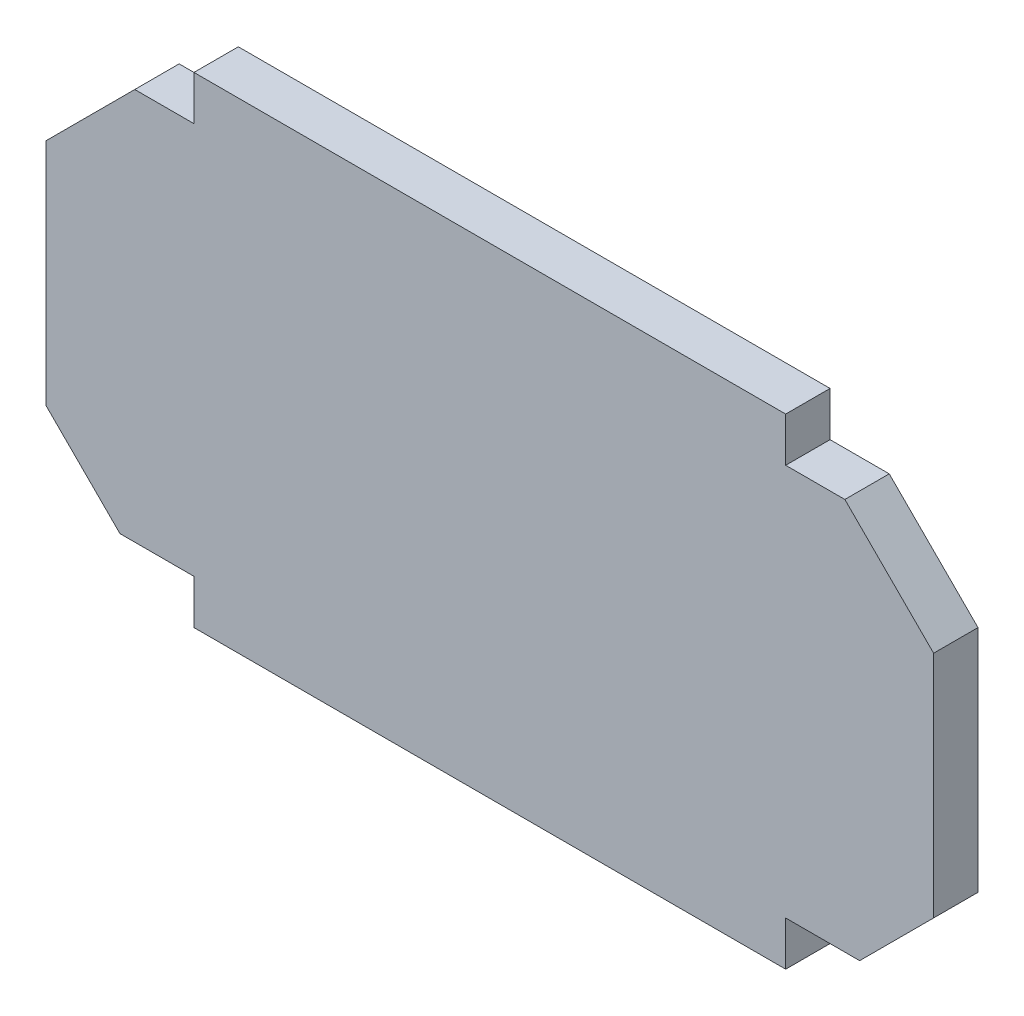
ISO-10303-21;
HEADER;
FILE_DESCRIPTION(('STEP AP214'),'2;1');
FILE_NAME('part.step','',(''),(''),'','','');
FILE_SCHEMA(('AUTOMOTIVE_DESIGN { 1 0 10303 214 1 1 1 1 }'));
ENDSEC;
DATA;
#1=APPLICATION_CONTEXT('core data for automotive mechanical design processes');
#2=APPLICATION_PROTOCOL_DEFINITION('international standard','automotive_design',2000,#1);
#3=PRODUCT_CONTEXT('',#1,'mechanical');
#4=PRODUCT('Part','Part','',(#3));
#5=PRODUCT_RELATED_PRODUCT_CATEGORY('part','',(#4));
#6=PRODUCT_DEFINITION_FORMATION('','',#4);
#7=PRODUCT_DEFINITION_CONTEXT('part definition',#1,'design');
#8=PRODUCT_DEFINITION('design','',#6,#7);
#9=PRODUCT_DEFINITION_SHAPE('','',#8);
#10=(LENGTH_UNIT() NAMED_UNIT(*) SI_UNIT(.MILLI.,.METRE.));
#11=(NAMED_UNIT(*) PLANE_ANGLE_UNIT() SI_UNIT($,.RADIAN.));
#12=(NAMED_UNIT(*) SI_UNIT($,.STERADIAN.) SOLID_ANGLE_UNIT());
#13=UNCERTAINTY_MEASURE_WITH_UNIT(LENGTH_MEASURE(1.E-05),#10,'distance_accuracy_value','');
#14=(GEOMETRIC_REPRESENTATION_CONTEXT(3) GLOBAL_UNCERTAINTY_ASSIGNED_CONTEXT((#13)) GLOBAL_UNIT_ASSIGNED_CONTEXT((#10,
#11,#12)) REPRESENTATION_CONTEXT('',''));
#15=CARTESIAN_POINT('',(0.,0.,0.));
#16=DIRECTION('',(0.,0.,1.));
#17=DIRECTION('',(1.,0.,0.));
#18=AXIS2_PLACEMENT_3D('',#15,#16,#17);
#19=CARTESIAN_POINT('',(-24.,31.5,3.));
#20=DIRECTION('',(0.707106781186547,-0.707106781186548,0.));
#21=DIRECTION('',(0.707106781186548,0.707106781186547,0.));
#22=AXIS2_PLACEMENT_3D('',#19,#20,#21);
#23=PLANE('',#22);
#24=DIRECTION('',(-0.707106781186548,-0.707106781186547,0.));
#25=VECTOR('',#24,1.);
#26=CARTESIAN_POINT('',(-24.,31.5,0.));
#27=LINE('',#26,#25);
#28=CARTESIAN_POINT('',(-24.,31.5,0.));
#29=VERTEX_POINT('',#28);
#30=CARTESIAN_POINT('',(-30.,25.5,0.));
#31=VERTEX_POINT('',#30);
#32=EDGE_CURVE('E188',#29,#31,#27,.T.);
#33=ORIENTED_EDGE('',*,*,#32,.T.);
#34=DIRECTION('',(0.,0.,-1.));
#35=VECTOR('',#34,1.);
#36=CARTESIAN_POINT('',(-30.,25.5,3.));
#37=LINE('',#36,#35);
#38=CARTESIAN_POINT('',(-30.,25.5,3.));
#39=VERTEX_POINT('',#38);
#40=EDGE_CURVE('E11',#39,#31,#37,.T.);
#41=ORIENTED_EDGE('',*,*,#40,.F.);
#42=DIRECTION('',(-0.707106781186548,-0.707106781186547,0.));
#43=VECTOR('',#42,1.);
#44=CARTESIAN_POINT('',(-24.,31.5,3.));
#45=LINE('',#44,#43);
#46=CARTESIAN_POINT('',(-24.,31.5,3.));
#47=VERTEX_POINT('',#46);
#48=EDGE_CURVE('E234',#47,#39,#45,.T.);
#49=ORIENTED_EDGE('',*,*,#48,.F.);
#50=DIRECTION('',(0.,0.,-1.));
#51=VECTOR('',#50,1.);
#52=CARTESIAN_POINT('',(-24.,31.5,3.));
#53=LINE('',#52,#51);
#54=EDGE_CURVE('E184',#47,#29,#53,.T.);
#55=ORIENTED_EDGE('',*,*,#54,.T.);
#56=EDGE_LOOP('',(#33,#41,#49,#55));
#57=FACE_BOUND('',#56,.T.);
#58=ADVANCED_FACE('F39',(#57),#23,.F.);
#59=CARTESIAN_POINT('',(-30.,25.5,3.));
#60=DIRECTION('',(1.,0.,0.));
#61=DIRECTION('',(0.,1.,0.));
#62=AXIS2_PLACEMENT_3D('',#59,#60,#61);
#63=PLANE('',#62);
#64=DIRECTION('',(0.,-1.,0.));
#65=VECTOR('',#64,1.);
#66=CARTESIAN_POINT('',(-30.,25.5,0.));
#67=LINE('',#66,#65);
#68=CARTESIAN_POINT('',(-30.,10.,0.));
#69=VERTEX_POINT('',#68);
#70=EDGE_CURVE('E192',#31,#69,#67,.T.);
#71=ORIENTED_EDGE('',*,*,#70,.T.);
#72=DIRECTION('',(0.,0.,-1.));
#73=VECTOR('',#72,1.);
#74=CARTESIAN_POINT('',(-30.,10.,3.));
#75=LINE('',#74,#73);
#76=CARTESIAN_POINT('',(-30.,10.,3.));
#77=VERTEX_POINT('',#76);
#78=EDGE_CURVE('E48',#77,#69,#75,.T.);
#79=ORIENTED_EDGE('',*,*,#78,.F.);
#80=DIRECTION('',(0.,-1.,0.));
#81=VECTOR('',#80,1.);
#82=CARTESIAN_POINT('',(-30.,25.5,3.));
#83=LINE('',#82,#81);
#84=EDGE_CURVE('E123',#39,#77,#83,.T.);
#85=ORIENTED_EDGE('',*,*,#84,.F.);
#86=ORIENTED_EDGE('',*,*,#40,.T.);
#87=EDGE_LOOP('',(#71,#79,#85,#86));
#88=FACE_BOUND('',#87,.T.);
#89=ADVANCED_FACE('F356',(#88),#63,.F.);
#90=CARTESIAN_POINT('',(-30.,10.,3.));
#91=DIRECTION('',(0.707106781186547,0.707106781186547,0.));
#92=DIRECTION('',(-0.707106781186548,0.707106781186548,0.));
#93=AXIS2_PLACEMENT_3D('',#90,#91,#92);
#94=PLANE('',#93);
#95=DIRECTION('',(0.707106781186548,-0.707106781186548,0.));
#96=VECTOR('',#95,1.);
#97=CARTESIAN_POINT('',(-30.,10.,0.));
#98=LINE('',#97,#96);
#99=CARTESIAN_POINT('',(-25.,5.00000000000004,0.));
#100=VERTEX_POINT('',#99);
#101=EDGE_CURVE('E195',#69,#100,#98,.T.);
#102=ORIENTED_EDGE('',*,*,#101,.T.);
#103=DIRECTION('',(0.,0.,-1.));
#104=VECTOR('',#103,1.);
#105=CARTESIAN_POINT('',(-25.,5.00000000000004,3.));
#106=LINE('',#105,#104);
#107=CARTESIAN_POINT('',(-25.,5.00000000000004,3.));
#108=VERTEX_POINT('',#107);
#109=EDGE_CURVE('E277',#108,#100,#106,.T.);
#110=ORIENTED_EDGE('',*,*,#109,.F.);
#111=DIRECTION('',(0.707106781186548,-0.707106781186548,0.));
#112=VECTOR('',#111,1.);
#113=CARTESIAN_POINT('',(-30.,10.,3.));
#114=LINE('',#113,#112);
#115=EDGE_CURVE('E287',#77,#108,#114,.T.);
#116=ORIENTED_EDGE('',*,*,#115,.F.);
#117=ORIENTED_EDGE('',*,*,#78,.T.);
#118=EDGE_LOOP('',(#102,#110,#116,#117));
#119=FACE_BOUND('',#118,.T.);
#120=ADVANCED_FACE('F285',(#119),#94,.F.);
#121=CARTESIAN_POINT('',(-25.,5.00000000000004,3.));
#122=DIRECTION('',(0.,1.,0.));
#123=DIRECTION('',(0.,0.,1.));
#124=AXIS2_PLACEMENT_3D('',#121,#122,#123);
#125=PLANE('',#124);
#126=DIRECTION('',(1.,0.,0.));
#127=VECTOR('',#126,1.);
#128=CARTESIAN_POINT('',(-25.,5.00000000000004,0.));
#129=LINE('',#128,#127);
#130=CARTESIAN_POINT('',(-20.,5.00000000000004,0.));
#131=VERTEX_POINT('',#130);
#132=EDGE_CURVE('E198',#100,#131,#129,.T.);
#133=ORIENTED_EDGE('',*,*,#132,.T.);
#134=DIRECTION('',(0.,0.,-1.));
#135=VECTOR('',#134,1.);
#136=CARTESIAN_POINT('',(-20.,5.00000000000004,3.));
#137=LINE('',#136,#135);
#138=CARTESIAN_POINT('',(-20.,5.00000000000004,3.));
#139=VERTEX_POINT('',#138);
#140=EDGE_CURVE('E273',#139,#131,#137,.T.);
#141=ORIENTED_EDGE('',*,*,#140,.F.);
#142=DIRECTION('',(1.,0.,0.));
#143=VECTOR('',#142,1.);
#144=CARTESIAN_POINT('',(-25.,5.00000000000004,3.));
#145=LINE('',#144,#143);
#146=EDGE_CURVE('E306',#108,#139,#145,.T.);
#147=ORIENTED_EDGE('',*,*,#146,.F.);
#148=ORIENTED_EDGE('',*,*,#109,.T.);
#149=EDGE_LOOP('',(#133,#141,#147,#148));
#150=FACE_BOUND('',#149,.T.);
#151=ADVANCED_FACE('F296',(#150),#125,.F.);
#152=CARTESIAN_POINT('',(-20.,5.00000000000004,3.));
#153=DIRECTION('',(1.,0.,0.));
#154=DIRECTION('',(0.,1.,0.));
#155=AXIS2_PLACEMENT_3D('',#152,#153,#154);
#156=PLANE('',#155);
#157=DIRECTION('',(0.,-1.,0.));
#158=VECTOR('',#157,1.);
#159=CARTESIAN_POINT('',(-20.,5.00000000000004,0.));
#160=LINE('',#159,#158);
#161=CARTESIAN_POINT('',(-20.,2.00000000000004,0.));
#162=VERTEX_POINT('',#161);
#163=EDGE_CURVE('E201',#131,#162,#160,.T.);
#164=ORIENTED_EDGE('',*,*,#163,.T.);
#165=DIRECTION('',(0.,0.,-1.));
#166=VECTOR('',#165,1.);
#167=CARTESIAN_POINT('',(-20.,2.00000000000004,3.));
#168=LINE('',#167,#166);
#169=CARTESIAN_POINT('',(-20.,2.00000000000004,3.));
#170=VERTEX_POINT('',#169);
#171=EDGE_CURVE('E269',#170,#162,#168,.T.);
#172=ORIENTED_EDGE('',*,*,#171,.F.);
#173=DIRECTION('',(0.,-1.,0.));
#174=VECTOR('',#173,1.);
#175=CARTESIAN_POINT('',(-20.,5.00000000000004,3.));
#176=LINE('',#175,#174);
#177=EDGE_CURVE('E302',#139,#170,#176,.T.);
#178=ORIENTED_EDGE('',*,*,#177,.F.);
#179=ORIENTED_EDGE('',*,*,#140,.T.);
#180=EDGE_LOOP('',(#164,#172,#178,#179));
#181=FACE_BOUND('',#180,.T.);
#182=ADVANCED_FACE('F300',(#181),#156,.F.);
#183=CARTESIAN_POINT('',(-20.,2.00000000000004,3.));
#184=DIRECTION('',(0.,1.,0.));
#185=DIRECTION('',(-1.,0.,0.));
#186=AXIS2_PLACEMENT_3D('',#183,#184,#185);
#187=PLANE('',#186);
#188=DIRECTION('',(1.,0.,0.));
#189=VECTOR('',#188,1.);
#190=CARTESIAN_POINT('',(-20.,2.00000000000004,0.));
#191=LINE('',#190,#189);
#192=CARTESIAN_POINT('',(20.,2.00000000000004,0.));
#193=VERTEX_POINT('',#192);
#194=EDGE_CURVE('E204',#162,#193,#191,.T.);
#195=ORIENTED_EDGE('',*,*,#194,.T.);
#196=DIRECTION('',(0.,0.,-1.));
#197=VECTOR('',#196,1.);
#198=CARTESIAN_POINT('',(20.,2.00000000000004,3.));
#199=LINE('',#198,#197);
#200=CARTESIAN_POINT('',(20.,2.00000000000004,3.));
#201=VERTEX_POINT('',#200);
#202=EDGE_CURVE('E265',#201,#193,#199,.T.);
#203=ORIENTED_EDGE('',*,*,#202,.F.);
#204=DIRECTION('',(1.,0.,0.));
#205=VECTOR('',#204,1.);
#206=CARTESIAN_POINT('',(-20.,2.00000000000004,3.));
#207=LINE('',#206,#205);
#208=EDGE_CURVE('E305',#170,#201,#207,.T.);
#209=ORIENTED_EDGE('',*,*,#208,.F.);
#210=ORIENTED_EDGE('',*,*,#171,.T.);
#211=EDGE_LOOP('',(#195,#203,#209,#210));
#212=FACE_BOUND('',#211,.T.);
#213=ADVANCED_FACE('F369',(#212),#187,.F.);
#214=CARTESIAN_POINT('',(20.,5.00000000000004,3.));
#215=DIRECTION('',(-1.,0.,0.));
#216=DIRECTION('',(0.,-1.,0.));
#217=AXIS2_PLACEMENT_3D('',#214,#215,#216);
#218=PLANE('',#217);
#219=DIRECTION('',(0.,1.,0.));
#220=VECTOR('',#219,1.);
#221=CARTESIAN_POINT('',(20.,5.00000000000004,0.));
#222=LINE('',#221,#220);
#223=CARTESIAN_POINT('',(20.,5.00000000000004,0.));
#224=VERTEX_POINT('',#223);
#225=EDGE_CURVE('E207',#193,#224,#222,.T.);
#226=ORIENTED_EDGE('',*,*,#225,.T.);
#227=DIRECTION('',(0.,0.,-1.));
#228=VECTOR('',#227,1.);
#229=CARTESIAN_POINT('',(20.,5.00000000000004,3.));
#230=LINE('',#229,#228);
#231=CARTESIAN_POINT('',(20.,5.00000000000004,3.));
#232=VERTEX_POINT('',#231);
#233=EDGE_CURVE('E261',#232,#224,#230,.T.);
#234=ORIENTED_EDGE('',*,*,#233,.F.);
#235=DIRECTION('',(0.,1.,0.));
#236=VECTOR('',#235,1.);
#237=CARTESIAN_POINT('',(20.,5.00000000000004,3.));
#238=LINE('',#237,#236);
#239=EDGE_CURVE('E310',#201,#232,#238,.T.);
#240=ORIENTED_EDGE('',*,*,#239,.F.);
#241=ORIENTED_EDGE('',*,*,#202,.T.);
#242=EDGE_LOOP('',(#226,#234,#240,#241));
#243=FACE_BOUND('',#242,.T.);
#244=ADVANCED_FACE('F372',(#243),#218,.F.);
#245=CARTESIAN_POINT('',(25.,5.00000000000004,3.));
#246=DIRECTION('',(0.,1.,0.));
#247=DIRECTION('',(-1.,0.,0.));
#248=AXIS2_PLACEMENT_3D('',#245,#246,#247);
#249=PLANE('',#248);
#250=DIRECTION('',(1.,0.,0.));
#251=VECTOR('',#250,1.);
#252=CARTESIAN_POINT('',(25.,5.00000000000004,0.));
#253=LINE('',#252,#251);
#254=CARTESIAN_POINT('',(25.,5.00000000000004,0.));
#255=VERTEX_POINT('',#254);
#256=EDGE_CURVE('E210',#224,#255,#253,.T.);
#257=ORIENTED_EDGE('',*,*,#256,.T.);
#258=DIRECTION('',(0.,0.,-1.));
#259=VECTOR('',#258,1.);
#260=CARTESIAN_POINT('',(25.,5.00000000000004,3.));
#261=LINE('',#260,#259);
#262=CARTESIAN_POINT('',(25.,5.00000000000004,3.));
#263=VERTEX_POINT('',#262);
#264=EDGE_CURVE('E257',#263,#255,#261,.T.);
#265=ORIENTED_EDGE('',*,*,#264,.F.);
#266=DIRECTION('',(1.,0.,0.));
#267=VECTOR('',#266,1.);
#268=CARTESIAN_POINT('',(25.,5.00000000000004,3.));
#269=LINE('',#268,#267);
#270=EDGE_CURVE('E317',#232,#263,#269,.T.);
#271=ORIENTED_EDGE('',*,*,#270,.F.);
#272=ORIENTED_EDGE('',*,*,#233,.T.);
#273=EDGE_LOOP('',(#257,#265,#271,#272));
#274=FACE_BOUND('',#273,.T.);
#275=ADVANCED_FACE('F376',(#274),#249,.F.);
#276=CARTESIAN_POINT('',(30.,10.,3.));
#277=DIRECTION('',(-0.707106781186548,0.707106781186547,0.));
#278=DIRECTION('',(-0.707106781186547,-0.707106781186548,0.));
#279=AXIS2_PLACEMENT_3D('',#276,#277,#278);
#280=PLANE('',#279);
#281=DIRECTION('',(0.707106781186548,0.707106781186548,0.));
#282=VECTOR('',#281,1.);
#283=CARTESIAN_POINT('',(30.,10.,0.));
#284=LINE('',#283,#282);
#285=CARTESIAN_POINT('',(30.,10.,0.));
#286=VERTEX_POINT('',#285);
#287=EDGE_CURVE('E213',#255,#286,#284,.T.);
#288=ORIENTED_EDGE('',*,*,#287,.T.);
#289=DIRECTION('',(0.,0.,-1.));
#290=VECTOR('',#289,1.);
#291=CARTESIAN_POINT('',(30.,10.,3.));
#292=LINE('',#291,#290);
#293=CARTESIAN_POINT('',(30.,10.,3.));
#294=VERTEX_POINT('',#293);
#295=EDGE_CURVE('E253',#294,#286,#292,.T.);
#296=ORIENTED_EDGE('',*,*,#295,.F.);
#297=DIRECTION('',(0.707106781186548,0.707106781186548,0.));
#298=VECTOR('',#297,1.);
#299=CARTESIAN_POINT('',(30.,10.,3.));
#300=LINE('',#299,#298);
#301=EDGE_CURVE('E320',#263,#294,#300,.T.);
#302=ORIENTED_EDGE('',*,*,#301,.F.);
#303=ORIENTED_EDGE('',*,*,#264,.T.);
#304=EDGE_LOOP('',(#288,#296,#302,#303));
#305=FACE_BOUND('',#304,.T.);
#306=ADVANCED_FACE('F380',(#305),#280,.F.);
#307=CARTESIAN_POINT('',(30.,25.5,3.));
#308=DIRECTION('',(-1.,0.,0.));
#309=DIRECTION('',(0.,-1.,0.));
#310=AXIS2_PLACEMENT_3D('',#307,#308,#309);
#311=PLANE('',#310);
#312=DIRECTION('',(0.,1.,0.));
#313=VECTOR('',#312,1.);
#314=CARTESIAN_POINT('',(30.,25.5,0.));
#315=LINE('',#314,#313);
#316=CARTESIAN_POINT('',(30.,25.5,0.));
#317=VERTEX_POINT('',#316);
#318=EDGE_CURVE('E216',#286,#317,#315,.T.);
#319=ORIENTED_EDGE('',*,*,#318,.T.);
#320=DIRECTION('',(0.,0.,-1.));
#321=VECTOR('',#320,1.);
#322=CARTESIAN_POINT('',(30.,25.5,3.));
#323=LINE('',#322,#321);
#324=CARTESIAN_POINT('',(30.,25.5,3.));
#325=VERTEX_POINT('',#324);
#326=EDGE_CURVE('E249',#325,#317,#323,.T.);
#327=ORIENTED_EDGE('',*,*,#326,.F.);
#328=DIRECTION('',(0.,1.,0.));
#329=VECTOR('',#328,1.);
#330=CARTESIAN_POINT('',(30.,25.5,3.));
#331=LINE('',#330,#329);
#332=EDGE_CURVE('E323',#294,#325,#331,.T.);
#333=ORIENTED_EDGE('',*,*,#332,.F.);
#334=ORIENTED_EDGE('',*,*,#295,.T.);
#335=EDGE_LOOP('',(#319,#327,#333,#334));
#336=FACE_BOUND('',#335,.T.);
#337=ADVANCED_FACE('F384',(#336),#311,.F.);
#338=CARTESIAN_POINT('',(24.,31.5,3.));
#339=DIRECTION('',(-0.707106781186547,-0.707106781186548,0.));
#340=DIRECTION('',(0.707106781186548,-0.707106781186547,0.));
#341=AXIS2_PLACEMENT_3D('',#338,#339,#340);
#342=PLANE('',#341);
#343=DIRECTION('',(-0.707106781186548,0.707106781186547,0.));
#344=VECTOR('',#343,1.);
#345=CARTESIAN_POINT('',(24.,31.5,0.));
#346=LINE('',#345,#344);
#347=CARTESIAN_POINT('',(24.,31.5,0.));
#348=VERTEX_POINT('',#347);
#349=EDGE_CURVE('E219',#317,#348,#346,.T.);
#350=ORIENTED_EDGE('',*,*,#349,.T.);
#351=DIRECTION('',(0.,0.,-1.));
#352=VECTOR('',#351,1.);
#353=CARTESIAN_POINT('',(24.,31.5,3.));
#354=LINE('',#353,#352);
#355=CARTESIAN_POINT('',(24.,31.5,3.));
#356=VERTEX_POINT('',#355);
#357=EDGE_CURVE('E245',#356,#348,#354,.T.);
#358=ORIENTED_EDGE('',*,*,#357,.F.);
#359=DIRECTION('',(-0.707106781186548,0.707106781186547,0.));
#360=VECTOR('',#359,1.);
#361=CARTESIAN_POINT('',(24.,31.5,3.));
#362=LINE('',#361,#360);
#363=EDGE_CURVE('E326',#325,#356,#362,.T.);
#364=ORIENTED_EDGE('',*,*,#363,.F.);
#365=ORIENTED_EDGE('',*,*,#326,.T.);
#366=EDGE_LOOP('',(#350,#358,#364,#365));
#367=FACE_BOUND('',#366,.T.);
#368=ADVANCED_FACE('F388',(#367),#342,.F.);
#369=CARTESIAN_POINT('',(20.,31.5,3.));
#370=DIRECTION('',(0.,-1.,0.));
#371=DIRECTION('',(0.,0.,-1.));
#372=AXIS2_PLACEMENT_3D('',#369,#370,#371);
#373=PLANE('',#372);
#374=DIRECTION('',(-1.,0.,0.));
#375=VECTOR('',#374,1.);
#376=CARTESIAN_POINT('',(20.,31.5,0.));
#377=LINE('',#376,#375);
#378=CARTESIAN_POINT('',(20.,31.5,0.));
#379=VERTEX_POINT('',#378);
#380=EDGE_CURVE('E222',#348,#379,#377,.T.);
#381=ORIENTED_EDGE('',*,*,#380,.T.);
#382=DIRECTION('',(0.,0.,-1.));
#383=VECTOR('',#382,1.);
#384=CARTESIAN_POINT('',(20.,31.5,3.));
#385=LINE('',#384,#383);
#386=CARTESIAN_POINT('',(20.,31.5,3.));
#387=VERTEX_POINT('',#386);
#388=EDGE_CURVE('E241',#387,#379,#385,.T.);
#389=ORIENTED_EDGE('',*,*,#388,.F.);
#390=DIRECTION('',(-1.,0.,0.));
#391=VECTOR('',#390,1.);
#392=CARTESIAN_POINT('',(20.,31.5,3.));
#393=LINE('',#392,#391);
#394=EDGE_CURVE('E329',#356,#387,#393,.T.);
#395=ORIENTED_EDGE('',*,*,#394,.F.);
#396=ORIENTED_EDGE('',*,*,#357,.T.);
#397=EDGE_LOOP('',(#381,#389,#395,#396));
#398=FACE_BOUND('',#397,.T.);
#399=ADVANCED_FACE('F337',(#398),#373,.F.);
#400=CARTESIAN_POINT('',(20.,34.5,3.));
#401=DIRECTION('',(-1.,0.,0.));
#402=DIRECTION('',(0.,0.,1.));
#403=AXIS2_PLACEMENT_3D('',#400,#401,#402);
#404=PLANE('',#403);
#405=DIRECTION('',(0.,1.,0.));
#406=VECTOR('',#405,1.);
#407=CARTESIAN_POINT('',(20.,34.5,0.));
#408=LINE('',#407,#406);
#409=CARTESIAN_POINT('',(20.,34.5,0.));
#410=VERTEX_POINT('',#409);
#411=EDGE_CURVE('E225',#379,#410,#408,.T.);
#412=ORIENTED_EDGE('',*,*,#411,.T.);
#413=DIRECTION('',(0.,0.,-1.));
#414=VECTOR('',#413,1.);
#415=CARTESIAN_POINT('',(20.,34.5,3.));
#416=LINE('',#415,#414);
#417=CARTESIAN_POINT('',(20.,34.5,3.));
#418=VERTEX_POINT('',#417);
#419=EDGE_CURVE('E177',#418,#410,#416,.T.);
#420=ORIENTED_EDGE('',*,*,#419,.F.);
#421=DIRECTION('',(0.,1.,0.));
#422=VECTOR('',#421,1.);
#423=CARTESIAN_POINT('',(20.,34.5,3.));
#424=LINE('',#423,#422);
#425=EDGE_CURVE('E166',#387,#418,#424,.T.);
#426=ORIENTED_EDGE('',*,*,#425,.F.);
#427=ORIENTED_EDGE('',*,*,#388,.T.);
#428=EDGE_LOOP('',(#412,#420,#426,#427));
#429=FACE_BOUND('',#428,.T.);
#430=ADVANCED_FACE('F341',(#429),#404,.F.);
#431=CARTESIAN_POINT('',(20.,34.5,3.));
#432=DIRECTION('',(0.,-1.,0.));
#433=DIRECTION('',(1.,0.,0.));
#434=AXIS2_PLACEMENT_3D('',#431,#432,#433);
#435=PLANE('',#434);
#436=DIRECTION('',(-1.,0.,0.));
#437=VECTOR('',#436,1.);
#438=CARTESIAN_POINT('',(20.,34.5,0.));
#439=LINE('',#438,#437);
#440=CARTESIAN_POINT('',(-20.,34.5,0.));
#441=VERTEX_POINT('',#440);
#442=EDGE_CURVE('E175',#410,#441,#439,.T.);
#443=ORIENTED_EDGE('',*,*,#442,.T.);
#444=DIRECTION('',(0.,0.,-1.));
#445=VECTOR('',#444,1.);
#446=CARTESIAN_POINT('',(-20.,34.5,3.));
#447=LINE('',#446,#445);
#448=CARTESIAN_POINT('',(-20.,34.5,3.));
#449=VERTEX_POINT('',#448);
#450=EDGE_CURVE('E172',#449,#441,#447,.T.);
#451=ORIENTED_EDGE('',*,*,#450,.F.);
#452=DIRECTION('',(-1.,0.,0.));
#453=VECTOR('',#452,1.);
#454=CARTESIAN_POINT('',(20.,34.5,3.));
#455=LINE('',#454,#453);
#456=EDGE_CURVE('E160',#418,#449,#455,.T.);
#457=ORIENTED_EDGE('',*,*,#456,.F.);
#458=ORIENTED_EDGE('',*,*,#419,.T.);
#459=EDGE_LOOP('',(#443,#451,#457,#458));
#460=FACE_BOUND('',#459,.T.);
#461=ADVANCED_FACE('F173',(#460),#435,.F.);
#462=CARTESIAN_POINT('',(-20.,34.5,3.));
#463=DIRECTION('',(1.,0.,0.));
#464=DIRECTION('',(0.,0.,-1.));
#465=AXIS2_PLACEMENT_3D('',#462,#463,#464);
#466=PLANE('',#465);
#467=DIRECTION('',(0.,-1.,0.));
#468=VECTOR('',#467,1.);
#469=CARTESIAN_POINT('',(-20.,34.5,0.));
#470=LINE('',#469,#468);
#471=CARTESIAN_POINT('',(-20.,31.5,0.));
#472=VERTEX_POINT('',#471);
#473=EDGE_CURVE('E109',#441,#472,#470,.T.);
#474=ORIENTED_EDGE('',*,*,#473,.T.);
#475=DIRECTION('',(0.,0.,-1.));
#476=VECTOR('',#475,1.);
#477=CARTESIAN_POINT('',(-20.,31.5,3.));
#478=LINE('',#477,#476);
#479=CARTESIAN_POINT('',(-20.,31.5,3.));
#480=VERTEX_POINT('',#479);
#481=EDGE_CURVE('E178',#480,#472,#478,.T.);
#482=ORIENTED_EDGE('',*,*,#481,.F.);
#483=DIRECTION('',(0.,-1.,0.));
#484=VECTOR('',#483,1.);
#485=CARTESIAN_POINT('',(-20.,34.5,3.));
#486=LINE('',#485,#484);
#487=EDGE_CURVE('E164',#449,#480,#486,.T.);
#488=ORIENTED_EDGE('',*,*,#487,.F.);
#489=ORIENTED_EDGE('',*,*,#450,.T.);
#490=EDGE_LOOP('',(#474,#482,#488,#489));
#491=FACE_BOUND('',#490,.T.);
#492=ADVANCED_FACE('F180',(#491),#466,.F.);
#493=CARTESIAN_POINT('',(-20.,31.5,3.));
#494=DIRECTION('',(0.,-1.,0.));
#495=DIRECTION('',(0.,0.,-1.));
#496=AXIS2_PLACEMENT_3D('',#493,#494,#495);
#497=PLANE('',#496);
#498=DIRECTION('',(-1.,0.,0.));
#499=VECTOR('',#498,1.);
#500=CARTESIAN_POINT('',(-20.,31.5,0.));
#501=LINE('',#500,#499);
#502=EDGE_CURVE('E115',#472,#29,#501,.T.);
#503=ORIENTED_EDGE('',*,*,#502,.T.);
#504=ORIENTED_EDGE('',*,*,#54,.F.);
#505=DIRECTION('',(-1.,0.,0.));
#506=VECTOR('',#505,1.);
#507=CARTESIAN_POINT('',(-20.,31.5,3.));
#508=LINE('',#507,#506);
#509=EDGE_CURVE('E56',#480,#47,#508,.T.);
#510=ORIENTED_EDGE('',*,*,#509,.F.);
#511=ORIENTED_EDGE('',*,*,#481,.T.);
#512=EDGE_LOOP('',(#503,#504,#510,#511));
#513=FACE_BOUND('',#512,.T.);
#514=ADVANCED_FACE('F345',(#513),#497,.F.);
#515=CARTESIAN_POINT('',(0.,0.,3.));
#516=DIRECTION('',(0.,0.,1.));
#517=DIRECTION('',(1.,0.,0.));
#518=AXIS2_PLACEMENT_3D('',#515,#516,#517);
#519=PLANE('',#518);
#520=ORIENTED_EDGE('',*,*,#48,.T.);
#521=ORIENTED_EDGE('',*,*,#84,.T.);
#522=ORIENTED_EDGE('',*,*,#115,.T.);
#523=ORIENTED_EDGE('',*,*,#146,.T.);
#524=ORIENTED_EDGE('',*,*,#177,.T.);
#525=ORIENTED_EDGE('',*,*,#208,.T.);
#526=ORIENTED_EDGE('',*,*,#239,.T.);
#527=ORIENTED_EDGE('',*,*,#270,.T.);
#528=ORIENTED_EDGE('',*,*,#301,.T.);
#529=ORIENTED_EDGE('',*,*,#332,.T.);
#530=ORIENTED_EDGE('',*,*,#363,.T.);
#531=ORIENTED_EDGE('',*,*,#394,.T.);
#532=ORIENTED_EDGE('',*,*,#425,.T.);
#533=ORIENTED_EDGE('',*,*,#456,.T.);
#534=ORIENTED_EDGE('',*,*,#487,.T.);
#535=ORIENTED_EDGE('',*,*,#509,.T.);
#536=EDGE_LOOP('',(#520,#521,#522,#523,#524,#525,#526,#527,#528,#529,#530,#531,#532,#533,#534,#535));
#537=FACE_BOUND('',#536,.T.);
#538=ADVANCED_FACE('F162',(#537),#519,.T.);
#539=CARTESIAN_POINT('',(0.,0.,0.));
#540=DIRECTION('',(0.,0.,1.));
#541=DIRECTION('',(1.,0.,0.));
#542=AXIS2_PLACEMENT_3D('',#539,#540,#541);
#543=PLANE('',#542);
#544=ORIENTED_EDGE('',*,*,#32,.F.);
#545=ORIENTED_EDGE('',*,*,#502,.F.);
#546=ORIENTED_EDGE('',*,*,#473,.F.);
#547=ORIENTED_EDGE('',*,*,#442,.F.);
#548=ORIENTED_EDGE('',*,*,#411,.F.);
#549=ORIENTED_EDGE('',*,*,#380,.F.);
#550=ORIENTED_EDGE('',*,*,#349,.F.);
#551=ORIENTED_EDGE('',*,*,#318,.F.);
#552=ORIENTED_EDGE('',*,*,#287,.F.);
#553=ORIENTED_EDGE('',*,*,#256,.F.);
#554=ORIENTED_EDGE('',*,*,#225,.F.);
#555=ORIENTED_EDGE('',*,*,#194,.F.);
#556=ORIENTED_EDGE('',*,*,#163,.F.);
#557=ORIENTED_EDGE('',*,*,#132,.F.);
#558=ORIENTED_EDGE('',*,*,#101,.F.);
#559=ORIENTED_EDGE('',*,*,#70,.F.);
#560=EDGE_LOOP('',(#544,#545,#546,#547,#548,#549,#550,#551,#552,#553,#554,#555,#556,#557,#558,#559));
#561=FACE_BOUND('',#560,.T.);
#562=ADVANCED_FACE('F291',(#561),#543,.F.);
#563=CLOSED_SHELL('',(#58,#89,#120,#151,#182,#213,#244,#275,#306,#337,#368,#399,#430,#461,#492,
#514,#538,#562));
#564=MANIFOLD_SOLID_BREP('B2',#563);
#565=ADVANCED_BREP_SHAPE_REPRESENTATION('',(#18,#564),#14);
#566=SHAPE_DEFINITION_REPRESENTATION(#9,#565);
ENDSEC;
END-ISO-10303-21;
